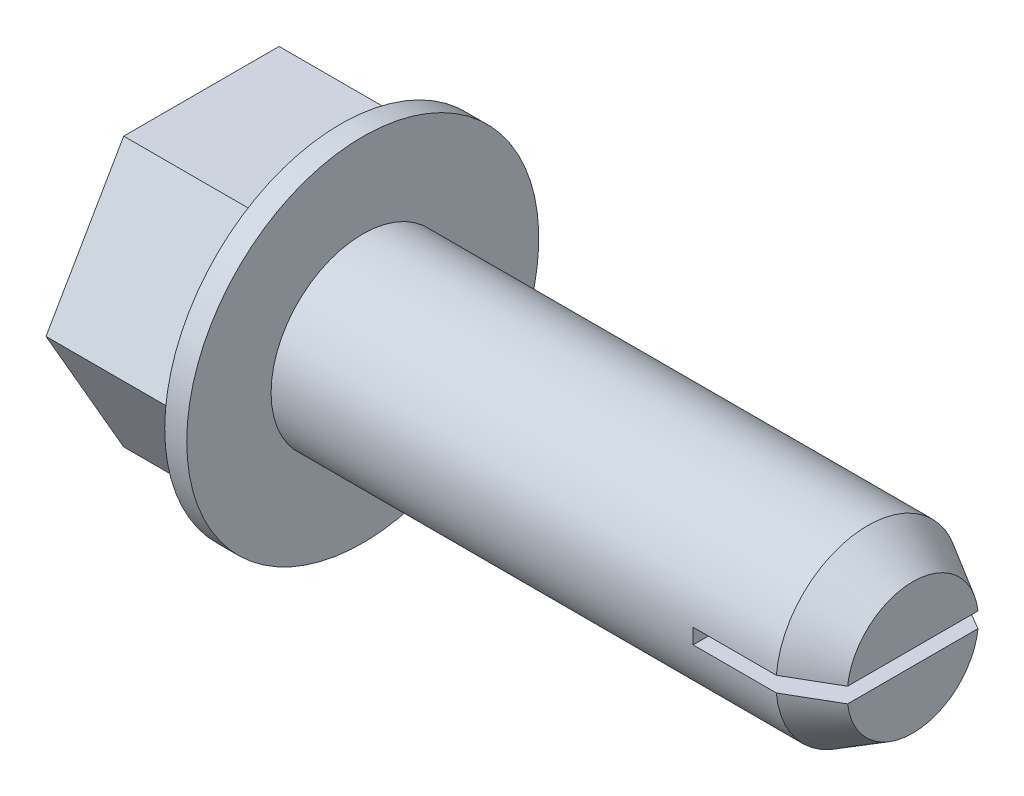
ISO-10303-21;
HEADER;
FILE_DESCRIPTION(('STEP AP214'),'2;1');
FILE_NAME('part.step','',(''),(''),'','','');
FILE_SCHEMA(('AUTOMOTIVE_DESIGN { 1 0 10303 214 1 1 1 1 }'));
ENDSEC;
DATA;
#1=APPLICATION_CONTEXT('core data for automotive mechanical design processes');
#2=APPLICATION_PROTOCOL_DEFINITION('international standard','automotive_design',2000,#1);
#3=PRODUCT_CONTEXT('',#1,'mechanical');
#4=PRODUCT('Part','Part','',(#3));
#5=PRODUCT_RELATED_PRODUCT_CATEGORY('part','',(#4));
#6=PRODUCT_DEFINITION_FORMATION('','',#4);
#7=PRODUCT_DEFINITION_CONTEXT('part definition',#1,'design');
#8=PRODUCT_DEFINITION('design','',#6,#7);
#9=PRODUCT_DEFINITION_SHAPE('','',#8);
#10=(LENGTH_UNIT() NAMED_UNIT(*) SI_UNIT(.MILLI.,.METRE.));
#11=(NAMED_UNIT(*) PLANE_ANGLE_UNIT() SI_UNIT($,.RADIAN.));
#12=(NAMED_UNIT(*) SI_UNIT($,.STERADIAN.) SOLID_ANGLE_UNIT());
#13=UNCERTAINTY_MEASURE_WITH_UNIT(LENGTH_MEASURE(1.E-05),#10,'distance_accuracy_value','');
#14=(GEOMETRIC_REPRESENTATION_CONTEXT(3) GLOBAL_UNCERTAINTY_ASSIGNED_CONTEXT((#13)) GLOBAL_UNIT_ASSIGNED_CONTEXT((#10,
#11,#12)) REPRESENTATION_CONTEXT('',''));
#15=CARTESIAN_POINT('',(0.,0.,0.));
#16=DIRECTION('',(0.,0.,1.));
#17=DIRECTION('',(1.,0.,0.));
#18=AXIS2_PLACEMENT_3D('',#15,#16,#17);
#19=CARTESIAN_POINT('',(17.4882097868151,0.,0.));
#20=DIRECTION('',(-1.,0.,0.));
#21=DIRECTION('',(0.,0.,1.));
#22=AXIS2_PLACEMENT_3D('',#19,#20,#21);
#23=CONICAL_SURFACE('',#22,3.175,0.523598775598292);
#24=CARTESIAN_POINT('',(13.5644644613219,0.264583333333333,-5.43393783266142));
#25=CARTESIAN_POINT('',(14.0871826436278,0.264583333333333,-5.13177479743097));
#26=CARTESIAN_POINT('',(14.6098866976322,0.264583333333333,-4.82958732171453));
#27=CARTESIAN_POINT('',(15.6552095136867,0.264583333333333,-4.22504701620635));
#28=CARTESIAN_POINT('',(16.1778282743568,0.264583333333333,-3.92269418402857));
#29=CARTESIAN_POINT('',(17.2241423772534,0.264583333333333,-3.31700106564912));
#30=CARTESIAN_POINT('',(17.7478373461747,0.264583333333333,-3.01366013407215));
#31=CARTESIAN_POINT('',(18.5330792932285,0.264583333333333,-2.55813812615807));
#32=CARTESIAN_POINT('',(18.794774905413,0.264583333333333,-2.4062132971754));
#33=CARTESIAN_POINT('',(19.3179928265594,0.264583333333333,-2.10206558022107));
#34=CARTESIAN_POINT('',(19.5795151356285,0.264583333333333,-1.94984269243398));
#35=CARTESIAN_POINT('',(19.9713214718428,0.264583333333333,-1.72119162168096));
#36=CARTESIAN_POINT('',(20.1017351693419,0.264583333333333,-1.64498568724022));
#37=CARTESIAN_POINT('',(20.3624339826788,0.264583333333333,-1.49234691242498));
#38=CARTESIAN_POINT('',(20.4927190953951,0.264583333333333,-1.41591406671424));
#39=CARTESIAN_POINT('',(20.7529729191661,0.264583333333333,-1.26275197273211));
#40=CARTESIAN_POINT('',(20.8829418010459,0.264583333333333,-1.18602301477345));
#41=CARTESIAN_POINT('',(21.14251237568,0.264583333333333,-1.03196432965892));
#42=CARTESIAN_POINT('',(21.2721140928904,0.264583333333333,-0.954634643864495));
#43=CARTESIAN_POINT('',(21.4659187118913,0.264583333333333,-0.837750528912931));
#44=CARTESIAN_POINT('',(21.5303977933951,0.264583333333333,-0.798654938496787));
#45=CARTESIAN_POINT('',(21.6590775625645,0.264583333333333,-0.719981892284));
#46=CARTESIAN_POINT('',(21.7232781975706,0.264583333333333,-0.680404350306108));
#47=CARTESIAN_POINT('',(21.8513452286603,0.264583333333333,-0.600412864954114));
#48=CARTESIAN_POINT('',(21.9152106571027,0.264583333333333,-0.559997359060232));
#49=CARTESIAN_POINT('',(22.0103272732384,0.264583333333333,-0.498347656476074));
#50=CARTESIAN_POINT('',(22.0419131277855,0.264583333333333,-0.477630823862634));
#51=CARTESIAN_POINT('',(22.1047544025035,0.264583333333333,-0.435703031053967));
#52=CARTESIAN_POINT('',(22.1360098430145,0.264583333333333,-0.414492101535705));
#53=CARTESIAN_POINT('',(22.1903340018692,0.264583333333333,-0.37667837356804));
#54=CARTESIAN_POINT('',(22.2135134700197,0.264583333333333,-0.360235070512369));
#55=CARTESIAN_POINT('',(22.2594652015796,0.264583333333333,-0.326749250525178));
#56=CARTESIAN_POINT('',(22.2822371615549,0.264583333333333,-0.309706312996171));
#57=CARTESIAN_POINT('',(22.327060694743,0.264583333333333,-0.274797007355579));
#58=CARTESIAN_POINT('',(22.3491137774706,0.264583333333333,-0.256932583966008));
#59=CARTESIAN_POINT('',(22.3920781971358,0.264583333333333,-0.219892857452947));
#60=CARTESIAN_POINT('',(22.4129911568137,0.264583333333333,-0.200719509836215));
#61=CARTESIAN_POINT('',(22.4452340578416,0.264583333333333,-0.167667232199067));
#62=CARTESIAN_POINT('',(22.4572435359932,0.264583333333333,-0.154459018855623));
#63=CARTESIAN_POINT('',(22.479742428192,0.264583333333333,-0.126788829304691));
#64=CARTESIAN_POINT('',(22.4902350299064,0.264583333333333,-0.112329587475477));
#65=CARTESIAN_POINT('',(22.5047631481339,0.264583333333333,-0.0879569053171079));
#66=CARTESIAN_POINT('',(22.5096896477211,0.264583333333333,-0.0785848776158666));
#67=CARTESIAN_POINT('',(22.5181377335612,0.264583333333333,-0.0592246580499537));
#68=CARTESIAN_POINT('',(22.5216621220232,0.264583333333333,-0.0492377417068181));
#69=CARTESIAN_POINT('',(22.526418522633,0.264583333333333,-0.0304037026103416));
#70=CARTESIAN_POINT('',(22.5279260208297,0.264583333333333,-0.0216280028123224));
#71=CARTESIAN_POINT('',(22.5294026767469,0.264583333333333,-0.00394842396421162));
#72=CARTESIAN_POINT('',(22.529372938949,0.264583333333333,0.00495535846215336));
#73=CARTESIAN_POINT('',(22.527783754397,0.264583333333333,0.0226015793310859));
#74=CARTESIAN_POINT('',(22.5262273778035,0.264583333333333,0.0313443057191699));
#75=CARTESIAN_POINT('',(22.521799885777,0.264583333333333,0.0484872271525425));
#76=CARTESIAN_POINT('',(22.5189273250771,0.264583333333333,0.0568870345760276));
#77=CARTESIAN_POINT('',(22.5097392618081,0.264583333333333,0.0791084101084659));
#78=CARTESIAN_POINT('',(22.5024306277301,0.264583333333333,0.0925118789448422));
#79=CARTESIAN_POINT('',(22.4859991306919,0.264583333333333,0.118165386221673));
#80=CARTESIAN_POINT('',(22.4768681425319,0.264583333333333,0.130409883182144));
#81=CARTESIAN_POINT('',(22.4502363411997,0.264583333333333,0.162907775207071));
#82=CARTESIAN_POINT('',(22.4316204301427,0.264583333333333,0.182229711479316));
#83=CARTESIAN_POINT('',(22.3928272705957,0.264583333333333,0.21926143600952));
#84=CARTESIAN_POINT('',(22.3726454888353,0.264583333333333,0.23696619389221));
#85=CARTESIAN_POINT('',(22.331293807366,0.264583333333333,0.271428766852513));
#86=CARTESIAN_POINT('',(22.3101188805033,0.264583333333333,0.288180532250144));
#87=CARTESIAN_POINT('',(22.2672661684661,0.264583333333333,0.320948333636695));
#88=CARTESIAN_POINT('',(22.2455892006051,0.264583333333333,0.336965454114015));
#89=CARTESIAN_POINT('',(22.1807081552448,0.264583333333333,0.383801752180299));
#90=CARTESIAN_POINT('',(22.1370014567618,0.264583333333333,0.413922038870454));
#91=CARTESIAN_POINT('',(22.048896754757,0.264583333333333,0.473137956582079));
#92=CARTESIAN_POINT('',(22.0044985971383,0.264583333333333,0.502233354347341));
#93=CARTESIAN_POINT('',(21.9152410723224,0.264583333333333,0.55980954616495));
#94=CARTESIAN_POINT('',(21.8703812772861,0.264583333333333,0.588289676499199));
#95=CARTESIAN_POINT('',(21.7803932808768,0.264583333333333,0.644823342437673));
#96=CARTESIAN_POINT('',(21.7352650728045,0.264583333333333,0.672876867331631));
#97=CARTESIAN_POINT('',(21.6000529942242,0.264583333333333,0.756326551992342));
#98=CARTESIAN_POINT('',(21.5097027331016,0.264583333333333,0.811290588678406));
#99=CARTESIAN_POINT('',(21.3286744912322,0.264583333333333,0.920566584265846));
#100=CARTESIAN_POINT('',(21.237996704292,0.264583333333333,0.97487886591951));
#101=CARTESIAN_POINT('',(20.9657460397315,0.264583333333333,1.13718911539779));
#102=CARTESIAN_POINT('',(20.7838413218696,0.264583333333333,1.24463004979448));
#103=CARTESIAN_POINT('',(20.4196512860542,0.264583333333333,1.45886639904696));
#104=CARTESIAN_POINT('',(20.2373659641305,0.264583333333333,1.5656618071235));
#105=CARTESIAN_POINT('',(19.872544735206,0.264583333333333,1.77891302602804));
#106=CARTESIAN_POINT('',(19.6900087832199,0.264583333333333,1.88536875994202));
#107=CARTESIAN_POINT('',(19.3248125987412,0.264583333333333,2.09806484028111));
#108=CARTESIAN_POINT('',(19.1421523667771,0.264583333333333,2.20430518761478));
#109=CARTESIAN_POINT('',(18.593482033195,0.264583333333333,2.52315422708799));
#110=CARTESIAN_POINT('',(18.2273529450556,0.264583333333333,2.73555815607347));
#111=CARTESIAN_POINT('',(17.4949677931199,0.264583333333333,3.1600954634988));
#112=CARTESIAN_POINT('',(17.1287117383933,0.264583333333333,3.37222885759761));
#113=CARTESIAN_POINT('',(16.4958030337913,0.264583333333333,3.73863282252731));
#114=CARTESIAN_POINT('',(16.2291708103373,0.264583333333333,3.89293867410942));
#115=CARTESIAN_POINT('',(15.6958693731254,0.264583333333333,4.20149757635999));
#116=CARTESIAN_POINT('',(15.4292001587852,0.264583333333333,4.35575062602182));
#117=CARTESIAN_POINT('',(14.896193932015,0.264583333333333,4.66401108570785));
#118=CARTESIAN_POINT('',(14.6298569504703,0.264583333333333,4.81801854913642));
#119=CARTESIAN_POINT('',(14.0971701645499,0.264583333333333,5.12600013471121));
#120=CARTESIAN_POINT('',(13.8308203604949,0.264583333333333,5.27997425741216));
#121=CARTESIAN_POINT('',(13.5644644613219,0.264583333333333,5.43393783266142));
#122=B_SPLINE_CURVE_WITH_KNOTS('',3,(#24,#25,#26,#27,#28,#29,#30,#31,#32,#33,#34,#35,#36,#37,
#38,#39,#40,#41,#42,#43,#44,#45,#46,#47,#48,#49,#50,#51,#52,#53,#54,#55,#56,#57,#58,#59,#60,#61,
#62,#63,#64,#65,#66,#67,#68,#69,#70,#71,#72,#73,#74,#75,#76,#77,#78,#79,#80,#81,#82,#83,#84,#85,
#86,#87,#88,#89,#90,#91,#92,#93,#94,#95,#96,#97,#98,#99,#100,#101,#102,#103,#104,#105,#106,#107,
#108,#109,#110,#111,#112,#113,#114,#115,#116,#117,#118,#119,#120,#121),.UNSPECIFIED.,.F.,.F.,(4,
2,2,2,2,2,2,2,2,2,2,2,2,2,2,2,2,2,2,2,2,2,2,2,2,2,2,2,2,2,2,2,2,2,2,2,2,2,2,2,2,2,2,2,2,2,2,2,
4),(0.,1.81130646860229,3.622639802236,5.43825212692843,6.34604704982731,7.25384141078979,
7.7069811118876,8.16013155518211,8.61291486136263,9.06566726394993,9.29188280622949,
9.51813941174702,9.74486462234725,9.85818301623115,9.97149439317706,10.0567476343856,
10.1420619154501,10.2271836969868,10.3121809794991,10.3656832581214,10.4190714160232,
10.4507572634153,10.4823794625921,10.5089710788502,10.5355435896841,10.5620627709669,
10.5886111423075,10.6341434787856,10.6798835544699,10.760150872277,10.8406599224638,
10.9216332565146,11.0024829336184,11.1616890535531,11.3209311763972,11.480337273529,
11.6397473660916,11.9570077621073,12.2741039642763,12.9078943665277,13.5416914132333,
14.1756230218318,14.8095519507311,16.0793915609185,17.3491539924864,18.2733440817586,
19.197550905017,20.120526080354,21.0434844930674),.UNSPECIFIED.);
#123=CARTESIAN_POINT('',(17.4882097868151,0.264583333333333,-3.16395648827891));
#124=VERTEX_POINT('',#123);
#125=CARTESIAN_POINT('',(19.05,0.264583333333333,-2.25785042678257));
#126=VERTEX_POINT('',#125);
#127=EDGE_CURVE('E542',#124,#126,#122,.T.);
#128=ORIENTED_EDGE('',*,*,#127,.F.);
#129=CARTESIAN_POINT('',(17.4882097868151,0.,0.));
#130=DIRECTION('',(-1.,0.,0.));
#131=DIRECTION('',(0.,0.,1.));
#132=AXIS2_PLACEMENT_3D('',#129,#130,#131);
#133=CIRCLE('',#132,3.175);
#134=CARTESIAN_POINT('',(17.4882097868151,0.264583333333333,3.16395648827891));
#135=VERTEX_POINT('',#134);
#136=EDGE_CURVE('E221',#135,#124,#133,.T.);
#137=ORIENTED_EDGE('',*,*,#136,.F.);
#138=CARTESIAN_POINT('',(19.05,0.264583333333333,2.25785042678256));
#139=VERTEX_POINT('',#138);
#140=EDGE_CURVE('E545',#139,#135,#122,.T.);
#141=ORIENTED_EDGE('',*,*,#140,.F.);
#142=CARTESIAN_POINT('',(19.05,0.,0.));
#143=DIRECTION('',(-1.,0.,0.));
#144=DIRECTION('',(0.,0.,1.));
#145=AXIS2_PLACEMENT_3D('',#142,#143,#144);
#146=CIRCLE('',#145,2.2733);
#147=EDGE_CURVE('E220',#139,#126,#146,.T.);
#148=ORIENTED_EDGE('',*,*,#147,.T.);
#149=EDGE_LOOP('',(#128,#137,#141,#148));
#150=FACE_BOUND('',#149,.T.);
#151=ADVANCED_FACE('F111',(#150),#23,.T.);
#152=CARTESIAN_POINT('',(19.05,3.175,0.));
#153=DIRECTION('',(-1.,0.,0.));
#154=DIRECTION('',(0.,0.,1.));
#155=AXIS2_PLACEMENT_3D('',#152,#153,#154);
#156=PLANE('',#155);
#157=ORIENTED_EDGE('',*,*,#147,.F.);
#158=DIRECTION('',(0.,0.,-1.));
#159=VECTOR('',#158,1.);
#160=CARTESIAN_POINT('',(19.05,0.264583333333333,0.));
#161=LINE('',#160,#159);
#162=EDGE_CURVE('E207',#139,#126,#161,.T.);
#163=ORIENTED_EDGE('',*,*,#162,.T.);
#164=EDGE_LOOP('',(#157,#163));
#165=FACE_BOUND('',#164,.T.);
#166=ADVANCED_FACE('F331',(#165),#156,.F.);
#167=CARTESIAN_POINT('',(0.,0.,0.));
#168=DIRECTION('',(-1.,0.,0.));
#169=DIRECTION('',(0.,0.,1.));
#170=AXIS2_PLACEMENT_3D('',#167,#168,#169);
#171=CYLINDRICAL_SURFACE('',#170,3.175);
#172=CARTESIAN_POINT('',(0.,0.,0.));
#173=DIRECTION('',(-1.,0.,0.));
#174=DIRECTION('',(0.,0.,1.));
#175=AXIS2_PLACEMENT_3D('',#172,#173,#174);
#176=CIRCLE('',#175,3.175);
#177=CARTESIAN_POINT('',(0.,0.,3.175));
#178=VERTEX_POINT('',#177);
#179=EDGE_CURVE('E208',#178,#178,#176,.T.);
#180=ORIENTED_EDGE('',*,*,#179,.F.);
#181=EDGE_LOOP('',(#180));
#182=FACE_BOUND('',#181,.T.);
#183=CARTESIAN_POINT('',(14.605,0.,0.));
#184=DIRECTION('',(-1.,0.,0.));
#185=DIRECTION('',(0.,0.,1.));
#186=AXIS2_PLACEMENT_3D('',#183,#184,#185);
#187=CIRCLE('',#186,3.175);
#188=CARTESIAN_POINT('',(14.605,-0.264583333333333,3.16395648827891));
#189=VERTEX_POINT('',#188);
#190=CARTESIAN_POINT('',(14.605,0.264583333333333,3.16395648827891));
#191=VERTEX_POINT('',#190);
#192=EDGE_CURVE('E84',#189,#191,#187,.T.);
#193=ORIENTED_EDGE('',*,*,#192,.T.);
#194=DIRECTION('',(-1.,0.,0.));
#195=VECTOR('',#194,1.);
#196=CARTESIAN_POINT('',(0.,0.264583333333333,3.16395648827891));
#197=LINE('',#196,#195);
#198=EDGE_CURVE('E308',#191,#135,#197,.F.);
#199=ORIENTED_EDGE('',*,*,#198,.T.);
#200=ORIENTED_EDGE('',*,*,#136,.T.);
#201=DIRECTION('',(-1.,0.,0.));
#202=VECTOR('',#201,1.);
#203=CARTESIAN_POINT('',(0.,0.264583333333333,-3.16395648827891));
#204=LINE('',#203,#202);
#205=CARTESIAN_POINT('',(14.605,0.264583333333333,-3.16395648827891));
#206=VERTEX_POINT('',#205);
#207=EDGE_CURVE('E296',#124,#206,#204,.T.);
#208=ORIENTED_EDGE('',*,*,#207,.T.);
#209=CARTESIAN_POINT('',(14.605,-0.264583333333333,-3.16395648827891));
#210=VERTEX_POINT('',#209);
#211=EDGE_CURVE('E115',#206,#210,#187,.T.);
#212=ORIENTED_EDGE('',*,*,#211,.T.);
#213=DIRECTION('',(-1.,0.,0.));
#214=VECTOR('',#213,1.);
#215=CARTESIAN_POINT('',(0.,-0.264583333333333,-3.16395648827891));
#216=LINE('',#215,#214);
#217=CARTESIAN_POINT('',(17.4882097868151,-0.264583333333333,-3.16395648827891));
#218=VERTEX_POINT('',#217);
#219=EDGE_CURVE('E216',#210,#218,#216,.F.);
#220=ORIENTED_EDGE('',*,*,#219,.T.);
#221=CARTESIAN_POINT('',(17.4882097868151,-0.264583333333333,3.16395648827891));
#222=VERTEX_POINT('',#221);
#223=EDGE_CURVE('E215',#218,#222,#133,.T.);
#224=ORIENTED_EDGE('',*,*,#223,.T.);
#225=DIRECTION('',(-1.,0.,0.));
#226=VECTOR('',#225,1.);
#227=CARTESIAN_POINT('',(0.,-0.264583333333333,3.16395648827891));
#228=LINE('',#227,#226);
#229=EDGE_CURVE('E548',#222,#189,#228,.T.);
#230=ORIENTED_EDGE('',*,*,#229,.T.);
#231=EDGE_LOOP('',(#193,#199,#200,#208,#212,#220,#224,#230));
#232=FACE_BOUND('',#231,.T.);
#233=ADVANCED_FACE('F295',(#182,#232),#171,.T.);
#234=CARTESIAN_POINT('',(-4.6228,3.72872,0.));
#235=DIRECTION('',(1.,0.,0.));
#236=DIRECTION('',(0.,0.,-1.));
#237=AXIS2_PLACEMENT_3D('',#234,#235,#236);
#238=PLANE('',#237);
#239=CARTESIAN_POINT('',(-4.6228,0.,0.));
#240=DIRECTION('',(-1.,0.,0.));
#241=DIRECTION('',(0.,0.,1.));
#242=AXIS2_PLACEMENT_3D('',#239,#240,#241);
#243=CIRCLE('',#242,3.72872);
#244=CARTESIAN_POINT('',(-4.6228,0.,3.72872));
#245=VERTEX_POINT('',#244);
#246=EDGE_CURVE('E275',#245,#245,#243,.T.);
#247=ORIENTED_EDGE('',*,*,#246,.T.);
#248=EDGE_LOOP('',(#247));
#249=FACE_BOUND('',#248,.T.);
#250=ADVANCED_FACE('F113',(#249),#238,.F.);
#251=CARTESIAN_POINT('',(0.,3.175,0.));
#252=DIRECTION('',(-1.,0.,0.));
#253=DIRECTION('',(0.,0.,1.));
#254=AXIS2_PLACEMENT_3D('',#251,#252,#253);
#255=PLANE('',#254);
#256=CARTESIAN_POINT('',(0.,0.,0.));
#257=DIRECTION('',(-1.,0.,0.));
#258=DIRECTION('',(0.,0.,1.));
#259=AXIS2_PLACEMENT_3D('',#256,#257,#258);
#260=CIRCLE('',#259,6.096);
#261=CARTESIAN_POINT('',(0.,0.,6.096));
#262=VERTEX_POINT('',#261);
#263=EDGE_CURVE('E285',#262,#262,#260,.T.);
#264=ORIENTED_EDGE('',*,*,#263,.F.);
#265=EDGE_LOOP('',(#264));
#266=FACE_BOUND('',#265,.T.);
#267=ORIENTED_EDGE('',*,*,#179,.T.);
#268=EDGE_LOOP('',(#267));
#269=FACE_BOUND('',#268,.T.);
#270=ADVANCED_FACE('F381',(#266,#269),#255,.F.);
#271=CARTESIAN_POINT('',(0.,0.,0.));
#272=DIRECTION('',(-1.,0.,0.));
#273=DIRECTION('',(0.,0.,1.));
#274=AXIS2_PLACEMENT_3D('',#271,#272,#273);
#275=CYLINDRICAL_SURFACE('',#274,6.096);
#276=CARTESIAN_POINT('',(-0.762,0.,0.));
#277=DIRECTION('',(-1.,0.,0.));
#278=DIRECTION('',(0.,0.,1.));
#279=AXIS2_PLACEMENT_3D('',#276,#277,#278);
#280=CIRCLE('',#279,6.096);
#281=CARTESIAN_POINT('',(-0.762,0.,6.096));
#282=VERTEX_POINT('',#281);
#283=EDGE_CURVE('E282',#282,#282,#280,.T.);
#284=ORIENTED_EDGE('',*,*,#283,.F.);
#285=EDGE_LOOP('',(#284));
#286=FACE_BOUND('',#285,.T.);
#287=ORIENTED_EDGE('',*,*,#263,.T.);
#288=EDGE_LOOP('',(#287));
#289=FACE_BOUND('',#288,.T.);
#290=ADVANCED_FACE('F377',(#286,#289),#275,.T.);
#291=CARTESIAN_POINT('',(-0.762,6.096,0.));
#292=DIRECTION('',(1.,0.,0.));
#293=DIRECTION('',(0.,0.,-1.));
#294=AXIS2_PLACEMENT_3D('',#291,#292,#293);
#295=PLANE('',#294);
#296=DIRECTION('',(0.,0.,1.));
#297=VECTOR('',#296,1.);
#298=CARTESIAN_POINT('',(-0.762000000008811,-4.6609,0.));
#299=LINE('',#298,#297);
#300=CARTESIAN_POINT('',(-0.762,-4.6609,-2.69097186966593));
#301=VERTEX_POINT('',#300);
#302=CARTESIAN_POINT('',(-0.762,-4.6609,2.69097186966593));
#303=VERTEX_POINT('',#302);
#304=EDGE_CURVE('E230',#301,#303,#299,.T.);
#305=ORIENTED_EDGE('',*,*,#304,.F.);
#306=DIRECTION('',(0.,-0.866025403784439,0.5));
#307=VECTOR('',#306,1.);
#308=CARTESIAN_POINT('',(-0.762000000008811,-10.7431892055105,0.820639440424721));
#309=LINE('',#308,#307);
#310=CARTESIAN_POINT('',(-0.761999999895124,0.,-5.38194373933185));
#311=VERTEX_POINT('',#310);
#312=EDGE_CURVE('E134',#311,#301,#309,.T.);
#313=ORIENTED_EDGE('',*,*,#312,.F.);
#314=DIRECTION('',(0.,-0.866025403784439,-0.5));
#315=VECTOR('',#314,1.);
#316=CARTESIAN_POINT('',(-0.762000000008811,-6.08228920551051,-8.8935550494225));
#317=LINE('',#316,#315);
#318=CARTESIAN_POINT('',(-0.762,4.6609,-2.69097186966593));
#319=VERTEX_POINT('',#318);
#320=EDGE_CURVE('E264',#319,#311,#317,.T.);
#321=ORIENTED_EDGE('',*,*,#320,.F.);
#322=DIRECTION('',(0.,0.,-1.));
#323=VECTOR('',#322,1.);
#324=CARTESIAN_POINT('',(-0.762000000008811,4.6609,0.));
#325=LINE('',#324,#323);
#326=CARTESIAN_POINT('',(-0.762,4.6609,2.69097186966593));
#327=VERTEX_POINT('',#326);
#328=EDGE_CURVE('E255',#327,#319,#325,.T.);
#329=ORIENTED_EDGE('',*,*,#328,.F.);
#330=DIRECTION('',(0.,0.866025403784439,-0.5));
#331=VECTOR('',#330,1.);
#332=CARTESIAN_POINT('',(-0.762000000008811,-6.08228920551051,8.8935550494225));
#333=LINE('',#332,#331);
#334=CARTESIAN_POINT('',(-0.762,0.,5.38194373933185));
#335=VERTEX_POINT('',#334);
#336=EDGE_CURVE('E246',#335,#327,#333,.T.);
#337=ORIENTED_EDGE('',*,*,#336,.F.);
#338=DIRECTION('',(0.,0.866025403784439,0.5));
#339=VECTOR('',#338,1.);
#340=CARTESIAN_POINT('',(-0.762000000008811,-10.7431892055105,-0.820639440424718));
#341=LINE('',#340,#339);
#342=EDGE_CURVE('E237',#303,#335,#341,.T.);
#343=ORIENTED_EDGE('',*,*,#342,.F.);
#344=EDGE_LOOP('',(#305,#313,#321,#329,#337,#343));
#345=FACE_BOUND('',#344,.T.);
#346=ORIENTED_EDGE('',*,*,#283,.T.);
#347=EDGE_LOOP('',(#346));
#348=FACE_BOUND('',#347,.T.);
#349=ADVANCED_FACE('F373',(#345,#348),#295,.F.);
#350=CARTESIAN_POINT('',(-5.588,4.6609,0.));
#351=DIRECTION('',(1.,0.,0.));
#352=DIRECTION('',(0.,0.,-1.));
#353=AXIS2_PLACEMENT_3D('',#350,#351,#352);
#354=PLANE('',#353);
#355=CARTESIAN_POINT('',(-5.588,0.,0.));
#356=DIRECTION('',(-1.,0.,0.));
#357=DIRECTION('',(0.,0.,1.));
#358=AXIS2_PLACEMENT_3D('',#355,#356,#357);
#359=CIRCLE('',#358,3.72872);
#360=CARTESIAN_POINT('',(-5.588,0.,3.72872));
#361=VERTEX_POINT('',#360);
#362=EDGE_CURVE('E279',#361,#361,#359,.T.);
#363=ORIENTED_EDGE('',*,*,#362,.F.);
#364=EDGE_LOOP('',(#363));
#365=FACE_BOUND('',#364,.T.);
#366=DIRECTION('',(0.,-0.866025403784439,0.5));
#367=VECTOR('',#366,1.);
#368=CARTESIAN_POINT('',(-5.588,-10.7431892055105,0.820639440424721));
#369=LINE('',#368,#367);
#370=CARTESIAN_POINT('',(-5.588,0.,-5.38194373933185));
#371=VERTEX_POINT('',#370);
#372=CARTESIAN_POINT('',(-5.588,-4.6609,-2.69097186966593));
#373=VERTEX_POINT('',#372);
#374=EDGE_CURVE('E270',#371,#373,#369,.T.);
#375=ORIENTED_EDGE('',*,*,#374,.T.);
#376=DIRECTION('',(0.,0.,1.));
#377=VECTOR('',#376,1.);
#378=CARTESIAN_POINT('',(-5.588,-4.6609,0.));
#379=LINE('',#378,#377);
#380=CARTESIAN_POINT('',(-5.588,-4.6609,2.69097186966593));
#381=VERTEX_POINT('',#380);
#382=EDGE_CURVE('E234',#373,#381,#379,.T.);
#383=ORIENTED_EDGE('',*,*,#382,.T.);
#384=DIRECTION('',(0.,0.866025403784439,0.5));
#385=VECTOR('',#384,1.);
#386=CARTESIAN_POINT('',(-5.588,-10.7431892055105,-0.820639440424718));
#387=LINE('',#386,#385);
#388=CARTESIAN_POINT('',(-5.588,0.,5.38194373933185));
#389=VERTEX_POINT('',#388);
#390=EDGE_CURVE('E243',#381,#389,#387,.T.);
#391=ORIENTED_EDGE('',*,*,#390,.T.);
#392=DIRECTION('',(0.,0.866025403784439,-0.5));
#393=VECTOR('',#392,1.);
#394=CARTESIAN_POINT('',(-5.588,-6.08228920551051,8.8935550494225));
#395=LINE('',#394,#393);
#396=CARTESIAN_POINT('',(-5.588,4.6609,2.69097186966592));
#397=VERTEX_POINT('',#396);
#398=EDGE_CURVE('E252',#389,#397,#395,.T.);
#399=ORIENTED_EDGE('',*,*,#398,.T.);
#400=DIRECTION('',(0.,0.,-1.));
#401=VECTOR('',#400,1.);
#402=CARTESIAN_POINT('',(-5.588,4.6609,0.));
#403=LINE('',#402,#401);
#404=CARTESIAN_POINT('',(-5.588,4.6609,-2.69097186966593));
#405=VERTEX_POINT('',#404);
#406=EDGE_CURVE('E261',#397,#405,#403,.T.);
#407=ORIENTED_EDGE('',*,*,#406,.T.);
#408=DIRECTION('',(0.,-0.866025403784439,-0.5));
#409=VECTOR('',#408,1.);
#410=CARTESIAN_POINT('',(-5.588,-6.08228920551051,-8.8935550494225));
#411=LINE('',#410,#409);
#412=EDGE_CURVE('E272',#405,#371,#411,.T.);
#413=ORIENTED_EDGE('',*,*,#412,.T.);
#414=EDGE_LOOP('',(#375,#383,#391,#399,#407,#413));
#415=FACE_BOUND('',#414,.T.);
#416=ADVANCED_FACE('F369',(#365,#415),#354,.F.);
#417=CARTESIAN_POINT('',(0.,0.,0.));
#418=DIRECTION('',(-1.,0.,0.));
#419=DIRECTION('',(0.,0.,1.));
#420=AXIS2_PLACEMENT_3D('',#417,#418,#419);
#421=CYLINDRICAL_SURFACE('',#420,3.72872);
#422=ORIENTED_EDGE('',*,*,#246,.F.);
#423=EDGE_LOOP('',(#422));
#424=FACE_BOUND('',#423,.T.);
#425=ORIENTED_EDGE('',*,*,#362,.T.);
#426=EDGE_LOOP('',(#425));
#427=FACE_BOUND('',#426,.T.);
#428=ADVANCED_FACE('F363',(#424,#427),#421,.F.);
#429=CARTESIAN_POINT('',(500000.,-10.7431892055105,0.820639440424721));
#430=DIRECTION('',(0.,-0.5,-0.866025403784439));
#431=DIRECTION('',(0.,0.866025403784439,-0.5));
#432=AXIS2_PLACEMENT_3D('',#429,#430,#431);
#433=PLANE('',#432);
#434=DIRECTION('',(-1.,0.,0.));
#435=VECTOR('',#434,1.);
#436=CARTESIAN_POINT('',(500000.,0.,-5.38194373933185));
#437=LINE('',#436,#435);
#438=EDGE_CURVE('E269',#311,#371,#437,.T.);
#439=ORIENTED_EDGE('',*,*,#438,.F.);
#440=ORIENTED_EDGE('',*,*,#312,.T.);
#441=DIRECTION('',(-1.,0.,0.));
#442=VECTOR('',#441,1.);
#443=CARTESIAN_POINT('',(500000.,-4.6609,-2.69097186966593));
#444=LINE('',#443,#442);
#445=EDGE_CURVE('E224',#301,#373,#444,.T.);
#446=ORIENTED_EDGE('',*,*,#445,.T.);
#447=ORIENTED_EDGE('',*,*,#374,.F.);
#448=EDGE_LOOP('',(#439,#440,#446,#447));
#449=FACE_BOUND('',#448,.T.);
#450=ADVANCED_FACE('F360',(#449),#433,.T.);
#451=CARTESIAN_POINT('',(500000.,-6.08228920551051,-8.8935550494225));
#452=DIRECTION('',(0.,0.5,-0.866025403784439));
#453=DIRECTION('',(0.,0.866025403784439,0.5));
#454=AXIS2_PLACEMENT_3D('',#451,#452,#453);
#455=PLANE('',#454);
#456=ORIENTED_EDGE('',*,*,#412,.F.);
#457=DIRECTION('',(-1.,0.,0.));
#458=VECTOR('',#457,1.);
#459=CARTESIAN_POINT('',(500000.,4.6609,-2.69097186966593));
#460=LINE('',#459,#458);
#461=EDGE_CURVE('E258',#319,#405,#460,.T.);
#462=ORIENTED_EDGE('',*,*,#461,.F.);
#463=ORIENTED_EDGE('',*,*,#320,.T.);
#464=ORIENTED_EDGE('',*,*,#438,.T.);
#465=EDGE_LOOP('',(#456,#462,#463,#464));
#466=FACE_BOUND('',#465,.T.);
#467=ADVANCED_FACE('F358',(#466),#455,.T.);
#468=CARTESIAN_POINT('',(500000.,4.6609,0.));
#469=DIRECTION('',(0.,1.,0.));
#470=DIRECTION('',(0.,0.,1.));
#471=AXIS2_PLACEMENT_3D('',#468,#469,#470);
#472=PLANE('',#471);
#473=ORIENTED_EDGE('',*,*,#406,.F.);
#474=DIRECTION('',(-1.,0.,0.));
#475=VECTOR('',#474,1.);
#476=CARTESIAN_POINT('',(500000.,4.6609,2.69097186966592));
#477=LINE('',#476,#475);
#478=EDGE_CURVE('E249',#327,#397,#477,.T.);
#479=ORIENTED_EDGE('',*,*,#478,.F.);
#480=ORIENTED_EDGE('',*,*,#328,.T.);
#481=ORIENTED_EDGE('',*,*,#461,.T.);
#482=EDGE_LOOP('',(#473,#479,#480,#481));
#483=FACE_BOUND('',#482,.T.);
#484=ADVANCED_FACE('F354',(#483),#472,.T.);
#485=CARTESIAN_POINT('',(500000.,-6.08228920551051,8.8935550494225));
#486=DIRECTION('',(0.,0.5,0.866025403784439));
#487=DIRECTION('',(0.,-0.866025403784439,0.5));
#488=AXIS2_PLACEMENT_3D('',#485,#486,#487);
#489=PLANE('',#488);
#490=ORIENTED_EDGE('',*,*,#398,.F.);
#491=DIRECTION('',(-1.,0.,0.));
#492=VECTOR('',#491,1.);
#493=CARTESIAN_POINT('',(500000.,0.,5.38194373933185));
#494=LINE('',#493,#492);
#495=EDGE_CURVE('E240',#335,#389,#494,.T.);
#496=ORIENTED_EDGE('',*,*,#495,.F.);
#497=ORIENTED_EDGE('',*,*,#336,.T.);
#498=ORIENTED_EDGE('',*,*,#478,.T.);
#499=EDGE_LOOP('',(#490,#496,#497,#498));
#500=FACE_BOUND('',#499,.T.);
#501=ADVANCED_FACE('F347',(#500),#489,.T.);
#502=CARTESIAN_POINT('',(500000.,-10.7431892055105,-0.820639440424718));
#503=DIRECTION('',(0.,-0.5,0.866025403784439));
#504=DIRECTION('',(0.,-0.866025403784439,-0.5));
#505=AXIS2_PLACEMENT_3D('',#502,#503,#504);
#506=PLANE('',#505);
#507=ORIENTED_EDGE('',*,*,#390,.F.);
#508=DIRECTION('',(-1.,0.,0.));
#509=VECTOR('',#508,1.);
#510=CARTESIAN_POINT('',(500000.,-4.6609,2.69097186966593));
#511=LINE('',#510,#509);
#512=EDGE_CURVE('E231',#303,#381,#511,.T.);
#513=ORIENTED_EDGE('',*,*,#512,.F.);
#514=ORIENTED_EDGE('',*,*,#342,.T.);
#515=ORIENTED_EDGE('',*,*,#495,.T.);
#516=EDGE_LOOP('',(#507,#513,#514,#515));
#517=FACE_BOUND('',#516,.T.);
#518=ADVANCED_FACE('F342',(#517),#506,.T.);
#519=CARTESIAN_POINT('',(500000.,-4.6609,0.));
#520=DIRECTION('',(0.,-1.,0.));
#521=DIRECTION('',(0.,0.,-1.));
#522=AXIS2_PLACEMENT_3D('',#519,#520,#521);
#523=PLANE('',#522);
#524=ORIENTED_EDGE('',*,*,#382,.F.);
#525=ORIENTED_EDGE('',*,*,#445,.F.);
#526=ORIENTED_EDGE('',*,*,#304,.T.);
#527=ORIENTED_EDGE('',*,*,#512,.T.);
#528=EDGE_LOOP('',(#524,#525,#526,#527));
#529=FACE_BOUND('',#528,.T.);
#530=ADVANCED_FACE('F338',(#529),#523,.T.);
#531=CARTESIAN_POINT('',(13.5644644613219,-0.264583333333333,5.43393783266142));
#532=CARTESIAN_POINT('',(14.0871826436278,-0.264583333333333,5.13177479743097));
#533=CARTESIAN_POINT('',(14.6098866976322,-0.264583333333333,4.82958732171453));
#534=CARTESIAN_POINT('',(15.6552095136867,-0.264583333333333,4.22504701620634));
#535=CARTESIAN_POINT('',(16.1778282743568,-0.264583333333333,3.92269418402857));
#536=CARTESIAN_POINT('',(17.2241423772534,-0.264583333333333,3.31700106564912));
#537=CARTESIAN_POINT('',(17.7478373461747,-0.264583333333333,3.01366013407215));
#538=CARTESIAN_POINT('',(18.5330792932285,-0.264583333333333,2.55813812615807));
#539=CARTESIAN_POINT('',(18.794774905413,-0.264583333333333,2.4062132971754));
#540=CARTESIAN_POINT('',(19.3179928265594,-0.264583333333333,2.10206558022107));
#541=CARTESIAN_POINT('',(19.5795151356285,-0.264583333333333,1.94984269243398));
#542=CARTESIAN_POINT('',(19.9713214718428,-0.264583333333333,1.72119162168097));
#543=CARTESIAN_POINT('',(20.1017351693419,-0.264583333333333,1.64498568724022));
#544=CARTESIAN_POINT('',(20.3624339826788,-0.264583333333333,1.49234691242498));
#545=CARTESIAN_POINT('',(20.4927190953951,-0.264583333333333,1.41591406671424));
#546=CARTESIAN_POINT('',(20.7529729191661,-0.264583333333333,1.26275197273211));
#547=CARTESIAN_POINT('',(20.8829418010459,-0.264583333333333,1.18602301477345));
#548=CARTESIAN_POINT('',(21.14251237568,-0.264583333333333,1.03196432965892));
#549=CARTESIAN_POINT('',(21.2721140928904,-0.264583333333333,0.954634643864495));
#550=CARTESIAN_POINT('',(21.4659187118913,-0.264583333333333,0.837750528912931));
#551=CARTESIAN_POINT('',(21.5303977933951,-0.264583333333333,0.798654938496787));
#552=CARTESIAN_POINT('',(21.6590775625645,-0.264583333333333,0.719981892283998));
#553=CARTESIAN_POINT('',(21.7232781975706,-0.264583333333333,0.680404350306105));
#554=CARTESIAN_POINT('',(21.8513452286603,-0.264583333333333,0.60041286495411));
#555=CARTESIAN_POINT('',(21.9152106571027,-0.264583333333333,0.55999735906023));
#556=CARTESIAN_POINT('',(22.0103272732384,-0.264583333333333,0.498347656476073));
#557=CARTESIAN_POINT('',(22.0419131277855,-0.264583333333333,0.477630823862632));
#558=CARTESIAN_POINT('',(22.1047544025035,-0.264583333333333,0.435703031053967));
#559=CARTESIAN_POINT('',(22.1360098430145,-0.264583333333333,0.414492101535704));
#560=CARTESIAN_POINT('',(22.1903340018692,-0.264583333333333,0.37667837356804));
#561=CARTESIAN_POINT('',(22.2135134700197,-0.264583333333333,0.360235070512369));
#562=CARTESIAN_POINT('',(22.2594652015796,-0.264583333333333,0.326749250525178));
#563=CARTESIAN_POINT('',(22.2822371615549,-0.264583333333333,0.30970631299617));
#564=CARTESIAN_POINT('',(22.327060694743,-0.264583333333333,0.274797007355579));
#565=CARTESIAN_POINT('',(22.3491137774706,-0.264583333333333,0.256932583966008));
#566=CARTESIAN_POINT('',(22.3920781971358,-0.264583333333333,0.219892857452947));
#567=CARTESIAN_POINT('',(22.4129911568137,-0.264583333333333,0.200719509836214));
#568=CARTESIAN_POINT('',(22.4452340578416,-0.264583333333333,0.167667232199067));
#569=CARTESIAN_POINT('',(22.4572435359932,-0.264583333333333,0.154459018855623));
#570=CARTESIAN_POINT('',(22.479742428192,-0.264583333333333,0.126788829304691));
#571=CARTESIAN_POINT('',(22.4902350299064,-0.264583333333333,0.112329587475477));
#572=CARTESIAN_POINT('',(22.5047631481339,-0.264583333333333,0.0879569053171077));
#573=CARTESIAN_POINT('',(22.5096896477211,-0.264583333333333,0.0785848776158665));
#574=CARTESIAN_POINT('',(22.5181377335612,-0.264583333333333,0.0592246580499535));
#575=CARTESIAN_POINT('',(22.5216621220232,-0.264583333333333,0.0492377417068179));
#576=CARTESIAN_POINT('',(22.526418522633,-0.264583333333333,0.0304037026103415));
#577=CARTESIAN_POINT('',(22.5279260208297,-0.264583333333333,0.0216280028123223));
#578=CARTESIAN_POINT('',(22.5294026767469,-0.264583333333333,0.0039484239642115));
#579=CARTESIAN_POINT('',(22.529372938949,-0.264583333333333,-0.00495535846215348));
#580=CARTESIAN_POINT('',(22.527783754397,-0.264583333333333,-0.022601579331086));
#581=CARTESIAN_POINT('',(22.5262273778035,-0.264583333333333,-0.03134430571917));
#582=CARTESIAN_POINT('',(22.521799885777,-0.264583333333333,-0.0484872271525425));
#583=CARTESIAN_POINT('',(22.5189273250771,-0.264583333333333,-0.0568870345760277));
#584=CARTESIAN_POINT('',(22.5097392618081,-0.264583333333333,-0.0791084101084659));
#585=CARTESIAN_POINT('',(22.5024306277301,-0.264583333333333,-0.0925118789448423));
#586=CARTESIAN_POINT('',(22.4859991306919,-0.264583333333333,-0.118165386221673));
#587=CARTESIAN_POINT('',(22.4768681425319,-0.264583333333333,-0.130409883182144));
#588=CARTESIAN_POINT('',(22.4502363411997,-0.264583333333333,-0.162907775207072));
#589=CARTESIAN_POINT('',(22.4316204301427,-0.264583333333333,-0.182229711479319));
#590=CARTESIAN_POINT('',(22.3928272705957,-0.264583333333333,-0.219261436009522));
#591=CARTESIAN_POINT('',(22.3726454888353,-0.264583333333333,-0.236966193892211));
#592=CARTESIAN_POINT('',(22.331293807366,-0.264583333333333,-0.271428766852512));
#593=CARTESIAN_POINT('',(22.3101188805033,-0.264583333333333,-0.288180532250143));
#594=CARTESIAN_POINT('',(22.2672661684661,-0.264583333333333,-0.320948333636694));
#595=CARTESIAN_POINT('',(22.2455892006051,-0.264583333333333,-0.336965454114015));
#596=CARTESIAN_POINT('',(22.1807081552448,-0.264583333333333,-0.383801752180299));
#597=CARTESIAN_POINT('',(22.1370014567618,-0.264583333333333,-0.413922038870453));
#598=CARTESIAN_POINT('',(22.048896754757,-0.264583333333333,-0.473137956582078));
#599=CARTESIAN_POINT('',(22.0044985971383,-0.264583333333333,-0.50223335434734));
#600=CARTESIAN_POINT('',(21.9152410723224,-0.264583333333333,-0.55980954616495));
#601=CARTESIAN_POINT('',(21.8703812772861,-0.264583333333333,-0.5882896764992));
#602=CARTESIAN_POINT('',(21.7803932808768,-0.264583333333333,-0.644823342437674));
#603=CARTESIAN_POINT('',(21.7352650728045,-0.264583333333333,-0.672876867331632));
#604=CARTESIAN_POINT('',(21.6000529942242,-0.264583333333333,-0.756326551992344));
#605=CARTESIAN_POINT('',(21.5097027331016,-0.264583333333333,-0.811290588678408));
#606=CARTESIAN_POINT('',(21.3286744912322,-0.264583333333333,-0.92056658426585));
#607=CARTESIAN_POINT('',(21.237996704292,-0.264583333333333,-0.974878865919514));
#608=CARTESIAN_POINT('',(20.9657460397315,-0.264583333333333,-1.13718911539779));
#609=CARTESIAN_POINT('',(20.7838413218696,-0.264583333333333,-1.24463004979449));
#610=CARTESIAN_POINT('',(20.4196512860542,-0.264583333333333,-1.45886639904696));
#611=CARTESIAN_POINT('',(20.2373659641305,-0.264583333333333,-1.56566180712351));
#612=CARTESIAN_POINT('',(19.872544735206,-0.264583333333333,-1.77891302602805));
#613=CARTESIAN_POINT('',(19.6900087832199,-0.264583333333333,-1.88536875994202));
#614=CARTESIAN_POINT('',(19.3248125987411,-0.264583333333333,-2.09806484028111));
#615=CARTESIAN_POINT('',(19.1421523667771,-0.264583333333333,-2.20430518761479));
#616=CARTESIAN_POINT('',(18.593482033195,-0.264583333333333,-2.523154227088));
#617=CARTESIAN_POINT('',(18.2273529450556,-0.264583333333333,-2.73555815607349));
#618=CARTESIAN_POINT('',(17.4949677931198,-0.264583333333333,-3.16009546349881));
#619=CARTESIAN_POINT('',(17.1287117383933,-0.264583333333333,-3.37222885759762));
#620=CARTESIAN_POINT('',(16.4958030337913,-0.264583333333333,-3.73863282252733));
#621=CARTESIAN_POINT('',(16.2291708103372,-0.264583333333333,-3.89293867410943));
#622=CARTESIAN_POINT('',(15.6958693731254,-0.264583333333333,-4.20149757636));
#623=CARTESIAN_POINT('',(15.4292001587852,-0.264583333333333,-4.35575062602183));
#624=CARTESIAN_POINT('',(14.8961939320149,-0.264583333333333,-4.66401108570785));
#625=CARTESIAN_POINT('',(14.6298569504703,-0.264583333333333,-4.81801854913642));
#626=CARTESIAN_POINT('',(14.0971701645499,-0.264583333333333,-5.12600013471121));
#627=CARTESIAN_POINT('',(13.8308203604949,-0.264583333333333,-5.27997425741216));
#628=CARTESIAN_POINT('',(13.5644644613219,-0.264583333333333,-5.43393783266142));
#629=B_SPLINE_CURVE_WITH_KNOTS('',3,(#531,#532,#533,#534,#535,#536,#537,#538,#539,#540,#541,
#542,#543,#544,#545,#546,#547,#548,#549,#550,#551,#552,#553,#554,#555,#556,#557,#558,#559,#560,
#561,#562,#563,#564,#565,#566,#567,#568,#569,#570,#571,#572,#573,#574,#575,#576,#577,#578,#579,
#580,#581,#582,#583,#584,#585,#586,#587,#588,#589,#590,#591,#592,#593,#594,#595,#596,#597,#598,
#599,#600,#601,#602,#603,#604,#605,#606,#607,#608,#609,#610,#611,#612,#613,#614,#615,#616,#617,
#618,#619,#620,#621,#622,#623,#624,#625,#626,#627,#628),.UNSPECIFIED.,.F.,.F.,(4,2,2,2,2,2,2,2,
2,2,2,2,2,2,2,2,2,2,2,2,2,2,2,2,2,2,2,2,2,2,2,2,2,2,2,2,2,2,2,2,2,2,2,2,2,2,2,2,4),(0.,
1.8113064686023,3.62263980223601,5.43825212692844,6.34604704982731,7.25384141078979,
7.7069811118876,8.16013155518211,8.61291486136263,9.06566726394994,9.2918828062295,
9.51813941174703,9.74486462234726,9.85818301623116,9.97149439317707,10.0567476343856,
10.1420619154501,10.2271836969868,10.3121809794991,10.3656832581214,10.4190714160232,
10.4507572634153,10.4823794625922,10.5089710788502,10.5355435896841,10.5620627709669,
10.5886111423075,10.6341434787857,10.6798835544699,10.760150872277,10.8406599224638,
10.9216332565146,11.0024829336184,11.1616890535531,11.3209311763972,11.480337273529,
11.6397473660916,11.9570077621073,12.2741039642763,12.9078943665277,13.5416914132333,
14.1756230218318,14.8095519507312,16.0793915609185,17.3491539924864,18.2733440817586,
19.197550905017,20.120526080354,21.0434844930674),.UNSPECIFIED.);
#630=CARTESIAN_POINT('',(19.05,-0.264583333333333,2.25785042678257));
#631=VERTEX_POINT('',#630);
#632=EDGE_CURVE('E126',#222,#631,#629,.T.);
#633=ORIENTED_EDGE('',*,*,#632,.F.);
#634=ORIENTED_EDGE('',*,*,#223,.F.);
#635=CARTESIAN_POINT('',(19.05,-0.264583333333333,-2.25785042678257));
#636=VERTEX_POINT('',#635);
#637=EDGE_CURVE('E202',#636,#218,#629,.T.);
#638=ORIENTED_EDGE('',*,*,#637,.F.);
#639=EDGE_CURVE('E213',#636,#631,#146,.T.);
#640=ORIENTED_EDGE('',*,*,#639,.T.);
#641=EDGE_LOOP('',(#633,#634,#638,#640));
#642=FACE_BOUND('',#641,.T.);
#643=ADVANCED_FACE('F212',(#642),#23,.T.);
#644=ORIENTED_EDGE('',*,*,#639,.F.);
#645=DIRECTION('',(0.,0.,1.));
#646=VECTOR('',#645,1.);
#647=CARTESIAN_POINT('',(19.05,-0.264583333333333,0.));
#648=LINE('',#647,#646);
#649=EDGE_CURVE('E199',#636,#631,#648,.T.);
#650=ORIENTED_EDGE('',*,*,#649,.T.);
#651=EDGE_LOOP('',(#644,#650));
#652=FACE_BOUND('',#651,.T.);
#653=ADVANCED_FACE('F219',(#652),#156,.F.);
#654=CARTESIAN_POINT('',(14.605,0.264583333333333,-6.096));
#655=DIRECTION('',(-1.,0.,0.));
#656=DIRECTION('',(0.,0.,1.));
#657=AXIS2_PLACEMENT_3D('',#654,#655,#656);
#658=PLANE('',#657);
#659=DIRECTION('',(0.,0.,1.));
#660=VECTOR('',#659,1.);
#661=CARTESIAN_POINT('',(14.605,0.264583333333333,-6.096));
#662=LINE('',#661,#660);
#663=EDGE_CURVE('E217',#206,#191,#662,.T.);
#664=ORIENTED_EDGE('',*,*,#663,.T.);
#665=ORIENTED_EDGE('',*,*,#192,.F.);
#666=DIRECTION('',(0.,0.,1.));
#667=VECTOR('',#666,1.);
#668=CARTESIAN_POINT('',(14.605,-0.264583333333333,-6.096));
#669=LINE('',#668,#667);
#670=EDGE_CURVE('E303',#210,#189,#669,.T.);
#671=ORIENTED_EDGE('',*,*,#670,.F.);
#672=ORIENTED_EDGE('',*,*,#211,.F.);
#673=EDGE_LOOP('',(#664,#665,#671,#672));
#674=FACE_BOUND('',#673,.T.);
#675=ADVANCED_FACE('F301',(#674),#658,.F.);
#676=CARTESIAN_POINT('',(14.605,0.264583333333333,-6.096));
#677=DIRECTION('',(0.,1.,0.));
#678=DIRECTION('',(0.,0.,1.));
#679=AXIS2_PLACEMENT_3D('',#676,#677,#678);
#680=PLANE('',#679);
#681=ORIENTED_EDGE('',*,*,#127,.T.);
#682=ORIENTED_EDGE('',*,*,#162,.F.);
#683=ORIENTED_EDGE('',*,*,#140,.T.);
#684=ORIENTED_EDGE('',*,*,#198,.F.);
#685=ORIENTED_EDGE('',*,*,#663,.F.);
#686=ORIENTED_EDGE('',*,*,#207,.F.);
#687=EDGE_LOOP('',(#681,#682,#683,#684,#685,#686));
#688=FACE_BOUND('',#687,.T.);
#689=ADVANCED_FACE('F305',(#688),#680,.F.);
#690=CARTESIAN_POINT('',(14.605,-0.264583333333333,-6.096));
#691=DIRECTION('',(0.,-1.,0.));
#692=DIRECTION('',(0.,0.,-1.));
#693=AXIS2_PLACEMENT_3D('',#690,#691,#692);
#694=PLANE('',#693);
#695=ORIENTED_EDGE('',*,*,#632,.T.);
#696=ORIENTED_EDGE('',*,*,#649,.F.);
#697=ORIENTED_EDGE('',*,*,#637,.T.);
#698=ORIENTED_EDGE('',*,*,#219,.F.);
#699=ORIENTED_EDGE('',*,*,#670,.T.);
#700=ORIENTED_EDGE('',*,*,#229,.F.);
#701=EDGE_LOOP('',(#695,#696,#697,#698,#699,#700));
#702=FACE_BOUND('',#701,.T.);
#703=ADVANCED_FACE('F201',(#702),#694,.F.);
#704=CLOSED_SHELL('',(#151,#166,#233,#250,#270,#290,#349,#416,#428,#450,#467,#484,#501,#518,
#530,#643,#653,#675,#689,#703));
#705=MANIFOLD_SOLID_BREP('B7',#704);
#706=ADVANCED_BREP_SHAPE_REPRESENTATION('',(#18,#705),#14);
#707=SHAPE_DEFINITION_REPRESENTATION(#9,#706);
ENDSEC;
END-ISO-10303-21;
